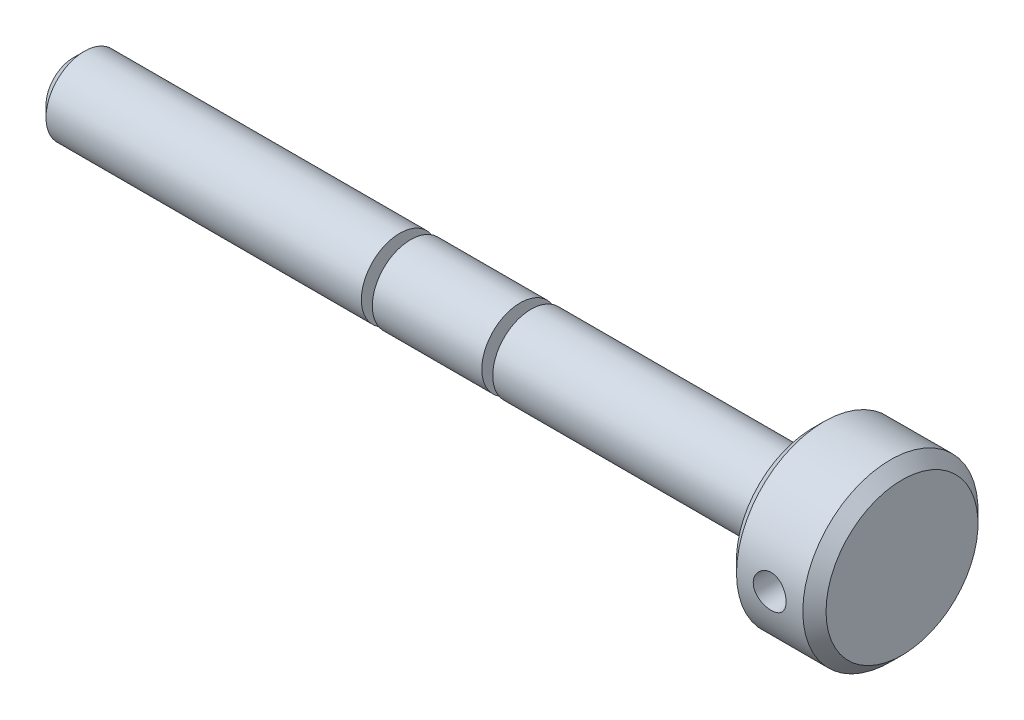
ISO-10303-21;
HEADER;
FILE_DESCRIPTION(('STEP AP214'),'2;1');
FILE_NAME('part.step','',(''),(''),'','','');
FILE_SCHEMA(('AUTOMOTIVE_DESIGN { 1 0 10303 214 1 1 1 1 }'));
ENDSEC;
DATA;
#1=APPLICATION_CONTEXT('core data for automotive mechanical design processes');
#2=APPLICATION_PROTOCOL_DEFINITION('international standard','automotive_design',2000,#1);
#3=PRODUCT_CONTEXT('',#1,'mechanical');
#4=PRODUCT('Part','Part','',(#3));
#5=PRODUCT_RELATED_PRODUCT_CATEGORY('part','',(#4));
#6=PRODUCT_DEFINITION_FORMATION('','',#4);
#7=PRODUCT_DEFINITION_CONTEXT('part definition',#1,'design');
#8=PRODUCT_DEFINITION('design','',#6,#7);
#9=PRODUCT_DEFINITION_SHAPE('','',#8);
#10=(LENGTH_UNIT() NAMED_UNIT(*) SI_UNIT(.MILLI.,.METRE.));
#11=(NAMED_UNIT(*) PLANE_ANGLE_UNIT() SI_UNIT($,.RADIAN.));
#12=(NAMED_UNIT(*) SI_UNIT($,.STERADIAN.) SOLID_ANGLE_UNIT());
#13=UNCERTAINTY_MEASURE_WITH_UNIT(LENGTH_MEASURE(1.E-05),#10,'distance_accuracy_value','');
#14=(GEOMETRIC_REPRESENTATION_CONTEXT(3) GLOBAL_UNCERTAINTY_ASSIGNED_CONTEXT((#13)) GLOBAL_UNIT_ASSIGNED_CONTEXT((#10,
#11,#12)) REPRESENTATION_CONTEXT('',''));
#15=CARTESIAN_POINT('',(0.,0.,0.));
#16=DIRECTION('',(0.,0.,1.));
#17=DIRECTION('',(1.,0.,0.));
#18=AXIS2_PLACEMENT_3D('',#15,#16,#17);
#19=CARTESIAN_POINT('',(-76.6389548693587,0.,0.));
#20=DIRECTION('',(-1.,0.,0.));
#21=DIRECTION('',(0.,0.,1.));
#22=AXIS2_PLACEMENT_3D('',#19,#20,#21);
#23=CYLINDRICAL_SURFACE('',#22,16.);
#24=CARTESIAN_POINT('',(60.4823451306413,0.,0.));
#25=DIRECTION('',(1.,0.,0.));
#26=DIRECTION('',(0.,0.,-1.));
#27=AXIS2_PLACEMENT_3D('',#24,#25,#26);
#28=CIRCLE('',#27,16.);
#29=CARTESIAN_POINT('',(60.4823451306413,0.,-16.));
#30=VERTEX_POINT('',#29);
#31=EDGE_CURVE('E50',#30,#30,#28,.T.);
#32=ORIENTED_EDGE('',*,*,#31,.T.);
#33=EDGE_LOOP('',(#32));
#34=FACE_BOUND('',#33,.T.);
#35=CARTESIAN_POINT('',(72.5936643705463,0.,0.));
#36=DIRECTION('',(-1.,0.,0.));
#37=DIRECTION('',(0.,0.,1.));
#38=AXIS2_PLACEMENT_3D('',#35,#36,#37);
#39=CIRCLE('',#38,16.);
#40=CARTESIAN_POINT('',(72.5936643705463,0.,16.));
#41=VERTEX_POINT('',#40);
#42=EDGE_CURVE('E55',#41,#41,#39,.T.);
#43=ORIENTED_EDGE('',*,*,#42,.T.);
#44=EDGE_LOOP('',(#43));
#45=FACE_BOUND('',#44,.T.);
#46=CARTESIAN_POINT('',(63.5380047505938,0.,-16.));
#47=CARTESIAN_POINT('',(63.5380111297704,0.166943492930942,-15.999996976677));
#48=CARTESIAN_POINT('',(63.5519869038326,0.333969985460196,-15.9973601984343));
#49=CARTESIAN_POINT('',(63.6074847408305,0.663316259683596,-15.9870957178104));
#50=CARTESIAN_POINT('',(63.6490300518733,0.825631948304454,-15.9794638033379));
#51=CARTESIAN_POINT('',(63.7583501531125,1.14074592370361,-15.9600627753092));
#52=CARTESIAN_POINT('',(63.8261012554989,1.29355266137069,-15.9482973989297));
#53=CARTESIAN_POINT('',(63.9858425044394,1.58561594618802,-15.9219142119957));
#54=CARTESIAN_POINT('',(64.0778306888835,1.72487358895465,-15.9072966323658));
#55=CARTESIAN_POINT('',(64.2846042866012,1.98756743186101,-15.8766267286101));
#56=CARTESIAN_POINT('',(64.3996236399341,2.11081791006367,-15.860560697127));
#57=CARTESIAN_POINT('',(64.6486913687689,2.33639212270739,-15.828906369173));
#58=CARTESIAN_POINT('',(64.7827411101324,2.43871435378483,-15.8133181070905));
#59=CARTESIAN_POINT('',(65.0673769273218,2.62029997331586,-15.7842510249001));
#60=CARTESIAN_POINT('',(65.2180854912283,2.69937443939211,-15.7707898777236));
#61=CARTESIAN_POINT('',(65.5309425809474,2.83101048664567,-15.7476942642397));
#62=CARTESIAN_POINT('',(65.6930901188162,2.88357435426197,-15.7380594679392));
#63=CARTESIAN_POINT('',(66.0222352124226,2.96010107007001,-15.723845391491));
#64=CARTESIAN_POINT('',(66.1891549450007,2.98438780384079,-15.7192089073281));
#65=CARTESIAN_POINT('',(66.5247595202103,3.00467616190693,-15.7153439430552));
#66=CARTESIAN_POINT('',(66.6934442031984,3.00068032270749,-15.7161149779752));
#67=CARTESIAN_POINT('',(67.0254438011259,2.96477959204726,-15.7229258540351));
#68=CARTESIAN_POINT('',(67.1888001791941,2.9332429999209,-15.7288961629467));
#69=CARTESIAN_POINT('',(67.5078615901591,2.84373598792414,-15.7453236656933));
#70=CARTESIAN_POINT('',(67.6635662976124,2.78576444478999,-15.7557810501903));
#71=CARTESIAN_POINT('',(67.9639821085944,2.644672943586,-15.7800771058518));
#72=CARTESIAN_POINT('',(68.1086216917555,2.56140427064912,-15.7939356764673));
#73=CARTESIAN_POINT('',(68.3820142076743,2.37218737860833,-15.8234594320584));
#74=CARTESIAN_POINT('',(68.5107655260234,2.26623685778533,-15.8391248003104));
#75=CARTESIAN_POINT('',(68.7508546619387,2.03267811370596,-15.8708000254433));
#76=CARTESIAN_POINT('',(68.8618860554973,1.90475487372137,-15.8868114204806));
#77=CARTESIAN_POINT('',(69.0609592319446,1.63193607419765,-15.9171477221664));
#78=CARTESIAN_POINT('',(69.1490007843347,1.48704034451154,-15.9314726119049));
#79=CARTESIAN_POINT('',(69.2996402583339,1.18406997774933,-15.9568507935502));
#80=CARTESIAN_POINT('',(69.3622063088296,1.02597912889298,-15.9678999827258));
#81=CARTESIAN_POINT('',(69.4598089367782,0.701278230797392,-15.9854501080544));
#82=CARTESIAN_POINT('',(69.4948484386845,0.534669088555576,-15.9919515273599));
#83=CARTESIAN_POINT('',(69.5359768126304,0.200297305806774,-15.9996072128396));
#84=CARTESIAN_POINT('',(69.5424855336533,0.0325880252682737,-16.0008390182456));
#85=CARTESIAN_POINT('',(69.5274937914985,-0.301522496184366,-15.9980308719646));
#86=CARTESIAN_POINT('',(69.5059947044633,-0.467923800960769,-15.9939911792886));
#87=CARTESIAN_POINT('',(69.4359466802271,-0.793363146436433,-15.9811422300081));
#88=CARTESIAN_POINT('',(69.3876101855182,-0.952448522092126,-15.9723704474806));
#89=CARTESIAN_POINT('',(69.2654893370363,-1.26025726364927,-15.95103684425));
#90=CARTESIAN_POINT('',(69.1917032554623,-1.40897992519021,-15.9384747662267));
#91=CARTESIAN_POINT('',(69.0198484942748,-1.69363334302643,-15.9107606071533));
#92=CARTESIAN_POINT('',(68.9215232735202,-1.82940655403024,-15.8955817234913));
#93=CARTESIAN_POINT('',(68.7037284758691,-2.08267664652909,-15.8643868697942));
#94=CARTESIAN_POINT('',(68.5842569245912,-2.20017181952174,-15.8483708216937));
#95=CARTESIAN_POINT('',(68.325660112771,-2.41514591744096,-15.817049513949));
#96=CARTESIAN_POINT('',(68.1862949343431,-2.51233832437154,-15.8017565172051));
#97=CARTESIAN_POINT('',(67.8929695015463,-2.68193350115574,-15.7738597115706));
#98=CARTESIAN_POINT('',(67.7390097898529,-2.75433719227849,-15.761255802747));
#99=CARTESIAN_POINT('',(67.4215930161088,-2.87189347025647,-15.7402604841915));
#100=CARTESIAN_POINT('',(67.2581859914752,-2.91717737589573,-15.7318488087376));
#101=CARTESIAN_POINT('',(66.925910305551,-2.97961358652472,-15.7201440760483));
#102=CARTESIAN_POINT('',(66.757042262653,-2.99676906541417,-15.7168504413158));
#103=CARTESIAN_POINT('',(66.4215080877108,-3.0023552429671,-15.7157839960771));
#104=CARTESIAN_POINT('',(66.2548495886798,-2.99123790006999,-15.7179243194859));
#105=CARTESIAN_POINT('',(65.9258219065032,-2.94158350757607,-15.7272920132));
#106=CARTESIAN_POINT('',(65.7634526977389,-2.90304662178665,-15.7345193531149));
#107=CARTESIAN_POINT('',(65.4478557810029,-2.79983775166527,-15.7532101604636));
#108=CARTESIAN_POINT('',(65.2946115679023,-2.73521470794506,-15.7646656918993));
#109=CARTESIAN_POINT('',(65.0010682421121,-2.58171737824409,-15.7905277510368));
#110=CARTESIAN_POINT('',(64.8607700449043,-2.49284137896372,-15.8049344872024));
#111=CARTESIAN_POINT('',(64.5948373905092,-2.29178974679071,-15.8353453221549));
#112=CARTESIAN_POINT('',(64.4694539254596,-2.17928519728608,-15.8513701070609));
#113=CARTESIAN_POINT('',(64.2391944256648,-1.93485585348459,-15.8830566783747));
#114=CARTESIAN_POINT('',(64.1343231086336,-1.80292660378323,-15.8987183805466));
#115=CARTESIAN_POINT('',(63.9471828453397,-1.52196989014374,-15.928079519361));
#116=CARTESIAN_POINT('',(63.8651258936125,-1.37279918128103,-15.9417600198112));
#117=CARTESIAN_POINT('',(63.7273694773835,-1.06258022730767,-15.9654323876137));
#118=CARTESIAN_POINT('',(63.6716452565,-0.901543303410495,-15.9754277175807));
#119=CARTESIAN_POINT('',(63.5994501217565,-0.616694405650308,-15.9885658141526));
#120=CARTESIAN_POINT('',(63.5764474899682,-0.494547620503742,-15.9928294175641));
#121=CARTESIAN_POINT('',(63.5457226263609,-0.248282494230317,-15.9985475990802));
#122=CARTESIAN_POINT('',(63.538000006082,-0.124164203305419,-16.0000022485961));
#123=CARTESIAN_POINT('',(63.5380047505938,0.,-16.));
#124=B_SPLINE_CURVE_WITH_KNOTS('',3,(#46,#47,#48,#49,#50,#51,#52,#53,#54,#55,#56,#57,#58,#59,
#60,#61,#62,#63,#64,#65,#66,#67,#68,#69,#70,#71,#72,#73,#74,#75,#76,#77,#78,#79,#80,#81,#82,#83,
#84,#85,#86,#87,#88,#89,#90,#91,#92,#93,#94,#95,#96,#97,#98,#99,#100,#101,#102,#103,#104,#105,
#106,#107,#108,#109,#110,#111,#112,#113,#114,#115,#116,#117,#118,#119,#120,#121,#122,#123),
.UNSPECIFIED.,.T.,.F.,(4,2,2,2,2,2,2,2,2,2,2,2,2,2,2,2,2,2,2,2,2,2,2,2,2,2,2,2,2,2,2,2,2,2,2,2,
2,2,4),(0.,0.500376401929849,1.0011752850709,1.50152254246182,2.00182930673782,2.50750236027261,
3.01321172567234,3.52292381008715,4.03259192623896,4.53636302890672,5.04008895174512,
5.53718001225533,6.03429219693575,6.53438525259063,7.0345290809972,7.54255536928156,
8.05058675089898,8.559251766434,9.06786273347493,9.56896348152196,10.0700396092917,
10.5672046781566,11.0644035067607,11.5670355603542,12.069714568262,12.579068739746,
13.0884039790989,13.5952525563712,14.1020439389303,14.600785044635,15.0995231708302,
15.5973299241539,16.0951718531085,16.6004673993276,17.1058790252452,17.6158409783263,
18.1253225386235,18.4974868904882,18.8696417807909),.UNSPECIFIED.);
#125=CARTESIAN_POINT('',(63.5380047505938,0.,-16.));
#126=VERTEX_POINT('',#125);
#127=EDGE_CURVE('E58',#126,#126,#124,.T.);
#128=ORIENTED_EDGE('',*,*,#127,.F.);
#129=EDGE_LOOP('',(#128));
#130=FACE_BOUND('',#129,.T.);
#131=CARTESIAN_POINT('',(69.5380047505938,0.,16.));
#132=CARTESIAN_POINT('',(69.5379983714173,0.166943492930942,15.999996976677));
#133=CARTESIAN_POINT('',(69.5240225973551,0.333969985460196,15.9973601984343));
#134=CARTESIAN_POINT('',(69.4685247603571,0.663316259683596,15.9870957178104));
#135=CARTESIAN_POINT('',(69.4269794493144,0.825631948304454,15.9794638033379));
#136=CARTESIAN_POINT('',(69.3176593480752,1.14074592370361,15.9600627753092));
#137=CARTESIAN_POINT('',(69.2499082456887,1.29355266137069,15.9482973989297));
#138=CARTESIAN_POINT('',(69.0901669967482,1.58561594618802,15.9219142119957));
#139=CARTESIAN_POINT('',(68.9981788123042,1.72487358895465,15.9072966323658));
#140=CARTESIAN_POINT('',(68.7914052145865,1.98756743186101,15.8766267286101));
#141=CARTESIAN_POINT('',(68.6763858612536,2.11081791006367,15.860560697127));
#142=CARTESIAN_POINT('',(68.4273181324187,2.33639212270739,15.828906369173));
#143=CARTESIAN_POINT('',(68.2932683910552,2.43871435378483,15.8133181070905));
#144=CARTESIAN_POINT('',(68.0086325738659,2.62029997331586,15.7842510249001));
#145=CARTESIAN_POINT('',(67.8579240099593,2.69937443939211,15.7707898777236));
#146=CARTESIAN_POINT('',(67.5450669202402,2.83101048664567,15.7476942642397));
#147=CARTESIAN_POINT('',(67.3829193823714,2.88357435426197,15.7380594679392));
#148=CARTESIAN_POINT('',(67.053774288765,2.96010107007001,15.723845391491));
#149=CARTESIAN_POINT('',(66.8868545561869,2.98438780384078,15.7192089073281));
#150=CARTESIAN_POINT('',(66.5512499809773,3.00467616190693,15.7153439430552));
#151=CARTESIAN_POINT('',(66.3825652979892,3.00068032270749,15.7161149779752));
#152=CARTESIAN_POINT('',(66.0505657000617,2.96477959204726,15.7229258540351));
#153=CARTESIAN_POINT('',(65.8872093219935,2.9332429999209,15.7288961629467));
#154=CARTESIAN_POINT('',(65.5681479110286,2.84373598792414,15.7453236656933));
#155=CARTESIAN_POINT('',(65.4124432035752,2.78576444478999,15.7557810501903));
#156=CARTESIAN_POINT('',(65.1120273925933,2.644672943586,15.7800771058518));
#157=CARTESIAN_POINT('',(64.9673878094322,2.56140427064912,15.7939356764673));
#158=CARTESIAN_POINT('',(64.6939952935133,2.37218737860833,15.8234594320584));
#159=CARTESIAN_POINT('',(64.5652439751642,2.26623685778533,15.8391248003104));
#160=CARTESIAN_POINT('',(64.3251548392489,2.03267811370596,15.8708000254433));
#161=CARTESIAN_POINT('',(64.2141234456903,1.90475487372137,15.8868114204806));
#162=CARTESIAN_POINT('',(64.015050269243,1.63193607419765,15.9171477221664));
#163=CARTESIAN_POINT('',(63.927008716853,1.48704034451154,15.9314726119049));
#164=CARTESIAN_POINT('',(63.7763692428538,1.18406997774933,15.9568507935502));
#165=CARTESIAN_POINT('',(63.713803192358,1.02597912889298,15.9678999827258));
#166=CARTESIAN_POINT('',(63.6162005644095,0.701278230797392,15.9854501080544));
#167=CARTESIAN_POINT('',(63.5811610625031,0.534669088555576,15.9919515273599));
#168=CARTESIAN_POINT('',(63.5400326885573,0.200297305806774,15.9996072128396));
#169=CARTESIAN_POINT('',(63.5335239675344,0.0325880252682737,16.0008390182456));
#170=CARTESIAN_POINT('',(63.5485157096891,-0.301522496184366,15.9980308719646));
#171=CARTESIAN_POINT('',(63.5700147967243,-0.467923800960769,15.9939911792886));
#172=CARTESIAN_POINT('',(63.6400628209605,-0.793363146436433,15.9811422300081));
#173=CARTESIAN_POINT('',(63.6883993156694,-0.952448522092126,15.9723704474806));
#174=CARTESIAN_POINT('',(63.8105201641514,-1.26025726364927,15.95103684425));
#175=CARTESIAN_POINT('',(63.8843062457254,-1.40897992519021,15.9384747662267));
#176=CARTESIAN_POINT('',(64.0561610069128,-1.69363334302643,15.9107606071533));
#177=CARTESIAN_POINT('',(64.1544862276675,-1.82940655403024,15.8955817234913));
#178=CARTESIAN_POINT('',(64.3722810253185,-2.08267664652909,15.8643868697942));
#179=CARTESIAN_POINT('',(64.4917525765965,-2.20017181952174,15.8483708216937));
#180=CARTESIAN_POINT('',(64.7503493884167,-2.41514591744096,15.817049513949));
#181=CARTESIAN_POINT('',(64.8897145668446,-2.51233832437153,15.8017565172051));
#182=CARTESIAN_POINT('',(65.1830399996413,-2.68193350115574,15.7738597115706));
#183=CARTESIAN_POINT('',(65.3369997113347,-2.75433719227849,15.761255802747));
#184=CARTESIAN_POINT('',(65.6544164850789,-2.87189347025647,15.7402604841915));
#185=CARTESIAN_POINT('',(65.8178235097125,-2.91717737589573,15.7318488087376));
#186=CARTESIAN_POINT('',(66.1500991956366,-2.97961358652472,15.7201440760483));
#187=CARTESIAN_POINT('',(66.3189672385346,-2.99676906541417,15.7168504413158));
#188=CARTESIAN_POINT('',(66.6545014134768,-3.0023552429671,15.7157839960771));
#189=CARTESIAN_POINT('',(66.8211599125078,-2.99123790006999,15.7179243194859));
#190=CARTESIAN_POINT('',(67.1501875946844,-2.94158350757607,15.7272920132));
#191=CARTESIAN_POINT('',(67.3125568034487,-2.90304662178665,15.7345193531149));
#192=CARTESIAN_POINT('',(67.6281537201848,-2.79983775166527,15.7532101604636));
#193=CARTESIAN_POINT('',(67.7813979332854,-2.73521470794506,15.7646656918993));
#194=CARTESIAN_POINT('',(68.0749412590755,-2.58171737824409,15.7905277510368));
#195=CARTESIAN_POINT('',(68.2152394562834,-2.49284137896372,15.8049344872024));
#196=CARTESIAN_POINT('',(68.4811721106784,-2.29178974679071,15.8353453221549));
#197=CARTESIAN_POINT('',(68.606555575728,-2.17928519728608,15.8513701070609));
#198=CARTESIAN_POINT('',(68.8368150755229,-1.93485585348459,15.8830566783747));
#199=CARTESIAN_POINT('',(68.9416863925541,-1.80292660378323,15.8987183805466));
#200=CARTESIAN_POINT('',(69.1288266558479,-1.52196989014374,15.928079519361));
#201=CARTESIAN_POINT('',(69.2108836075751,-1.37279918128103,15.9417600198112));
#202=CARTESIAN_POINT('',(69.3486400238041,-1.06258022730767,15.9654323876137));
#203=CARTESIAN_POINT('',(69.4043642446877,-0.901543303410495,15.9754277175807));
#204=CARTESIAN_POINT('',(69.4765593794312,-0.616694405650308,15.9885658141526));
#205=CARTESIAN_POINT('',(69.4995620112194,-0.494547620503742,15.9928294175641));
#206=CARTESIAN_POINT('',(69.5302868748267,-0.248282494230317,15.9985475990802));
#207=CARTESIAN_POINT('',(69.5380094951056,-0.124164203305419,16.0000022485961));
#208=CARTESIAN_POINT('',(69.5380047505938,0.,16.));
#209=B_SPLINE_CURVE_WITH_KNOTS('',3,(#131,#132,#133,#134,#135,#136,#137,#138,#139,#140,#141,
#142,#143,#144,#145,#146,#147,#148,#149,#150,#151,#152,#153,#154,#155,#156,#157,#158,#159,#160,
#161,#162,#163,#164,#165,#166,#167,#168,#169,#170,#171,#172,#173,#174,#175,#176,#177,#178,#179,
#180,#181,#182,#183,#184,#185,#186,#187,#188,#189,#190,#191,#192,#193,#194,#195,#196,#197,#198,
#199,#200,#201,#202,#203,#204,#205,#206,#207,#208),.UNSPECIFIED.,.T.,.F.,(4,2,2,2,2,2,2,2,2,2,2,
2,2,2,2,2,2,2,2,2,2,2,2,2,2,2,2,2,2,2,2,2,2,2,2,2,2,2,4),(0.,0.500376401929849,1.0011752850709,
1.50152254246182,2.00182930673782,2.50750236027261,3.01321172567234,3.52292381008715,
4.03259192623896,4.53636302890671,5.04008895174512,5.53718001225533,6.03429219693575,
6.53438525259063,7.0345290809972,7.54255536928156,8.05058675089898,8.559251766434,
9.06786273347493,9.56896348152195,10.0700396092917,10.5672046781566,11.0644035067607,
11.5670355603542,12.069714568262,12.579068739746,13.0884039790989,13.5952525563712,
14.1020439389303,14.600785044635,15.0995231708302,15.5973299241539,16.0951718531085,
16.6004673993276,17.1058790252452,17.6158409783263,18.1253225386235,18.4974868904882,
18.8696417807909),.UNSPECIFIED.);
#210=CARTESIAN_POINT('',(69.5380047505938,0.,16.));
#211=VERTEX_POINT('',#210);
#212=EDGE_CURVE('E41',#211,#211,#209,.T.);
#213=ORIENTED_EDGE('',*,*,#212,.F.);
#214=EDGE_LOOP('',(#213));
#215=FACE_BOUND('',#214,.T.);
#216=ADVANCED_FACE('F37',(#34,#45,#130,#215),#23,.T.);
#217=CARTESIAN_POINT('',(-76.6389548693587,7.,0.));
#218=DIRECTION('',(1.,0.,0.));
#219=DIRECTION('',(0.,0.,-1.));
#220=AXIS2_PLACEMENT_3D('',#217,#218,#219);
#221=PLANE('',#220);
#222=CARTESIAN_POINT('',(-76.6389548693587,0.,0.));
#223=DIRECTION('',(1.,0.,0.));
#224=DIRECTION('',(0.,0.,-1.));
#225=AXIS2_PLACEMENT_3D('',#222,#223,#224);
#226=CIRCLE('',#225,4.99999999999999);
#227=CARTESIAN_POINT('',(-76.6389548693587,0.,-4.99999999999999));
#228=VERTEX_POINT('',#227);
#229=EDGE_CURVE('E165',#228,#228,#226,.F.);
#230=ORIENTED_EDGE('',*,*,#229,.T.);
#231=EDGE_LOOP('',(#230));
#232=FACE_BOUND('',#231,.T.);
#233=ADVANCED_FACE('F115',(#232),#221,.F.);
#234=CARTESIAN_POINT('',(74.7149643705463,0.,0.));
#235=DIRECTION('',(-1.,0.,0.));
#236=DIRECTION('',(0.,0.,1.));
#237=AXIS2_PLACEMENT_3D('',#234,#235,#236);
#238=PLANE('',#237);
#239=CARTESIAN_POINT('',(74.7149643705463,0.,0.));
#240=DIRECTION('',(-1.,0.,0.));
#241=DIRECTION('',(0.,0.,1.));
#242=AXIS2_PLACEMENT_3D('',#239,#240,#241);
#243=CIRCLE('',#242,13.8787);
#244=CARTESIAN_POINT('',(74.7149643705463,0.,13.8787));
#245=VERTEX_POINT('',#244);
#246=EDGE_CURVE('E10',#245,#245,#243,.F.);
#247=ORIENTED_EDGE('',*,*,#246,.T.);
#248=EDGE_LOOP('',(#247));
#249=FACE_BOUND('',#248,.T.);
#250=ADVANCED_FACE('F110',(#249),#238,.F.);
#251=CARTESIAN_POINT('',(58.3610451306413,16.,0.));
#252=DIRECTION('',(1.,0.,0.));
#253=DIRECTION('',(0.,0.,-1.));
#254=AXIS2_PLACEMENT_3D('',#251,#252,#253);
#255=PLANE('',#254);
#256=CARTESIAN_POINT('',(58.3610451306413,0.,0.));
#257=DIRECTION('',(1.,0.,0.));
#258=DIRECTION('',(0.,0.,-1.));
#259=AXIS2_PLACEMENT_3D('',#256,#257,#258);
#260=CIRCLE('',#259,13.8787);
#261=CARTESIAN_POINT('',(58.3610451306413,0.,-13.8787));
#262=VERTEX_POINT('',#261);
#263=EDGE_CURVE('E171',#262,#262,#260,.F.);
#264=ORIENTED_EDGE('',*,*,#263,.T.);
#265=EDGE_LOOP('',(#264));
#266=FACE_BOUND('',#265,.T.);
#267=CARTESIAN_POINT('',(58.3610451306413,0.,0.));
#268=DIRECTION('',(-1.,0.,0.));
#269=DIRECTION('',(0.,0.,1.));
#270=AXIS2_PLACEMENT_3D('',#267,#268,#269);
#271=CIRCLE('',#270,7.00000000000003);
#272=CARTESIAN_POINT('',(58.3610451306413,0.,7.00000000000003));
#273=VERTEX_POINT('',#272);
#274=EDGE_CURVE('E162',#273,#273,#271,.T.);
#275=ORIENTED_EDGE('',*,*,#274,.F.);
#276=EDGE_LOOP('',(#275));
#277=FACE_BOUND('',#276,.T.);
#278=ADVANCED_FACE('F107',(#266,#277),#255,.F.);
#279=CARTESIAN_POINT('',(-76.6389548693587,0.,0.));
#280=DIRECTION('',(-1.,0.,0.));
#281=DIRECTION('',(0.,0.,1.));
#282=AXIS2_PLACEMENT_3D('',#279,#280,#281);
#283=CYLINDRICAL_SURFACE('',#282,7.00000000000002);
#284=CARTESIAN_POINT('',(6.96104513064133,0.,0.));
#285=DIRECTION('',(-1.,0.,0.));
#286=DIRECTION('',(0.,0.,1.));
#287=AXIS2_PLACEMENT_3D('',#284,#285,#286);
#288=CIRCLE('',#287,7.00000000000002);
#289=CARTESIAN_POINT('',(6.96104513064133,0.,7.00000000000002));
#290=VERTEX_POINT('',#289);
#291=EDGE_CURVE('E159',#290,#290,#288,.T.);
#292=ORIENTED_EDGE('',*,*,#291,.F.);
#293=EDGE_LOOP('',(#292));
#294=FACE_BOUND('',#293,.T.);
#295=ORIENTED_EDGE('',*,*,#274,.T.);
#296=EDGE_LOOP('',(#295));
#297=FACE_BOUND('',#296,.T.);
#298=ADVANCED_FACE('F104',(#294,#297),#283,.T.);
#299=CARTESIAN_POINT('',(6.96104513064133,7.00000000000002,0.));
#300=DIRECTION('',(1.,0.,0.));
#301=DIRECTION('',(0.,0.,-1.));
#302=AXIS2_PLACEMENT_3D('',#299,#300,#301);
#303=PLANE('',#302);
#304=CARTESIAN_POINT('',(6.96104513064133,0.,0.));
#305=DIRECTION('',(-1.,0.,0.));
#306=DIRECTION('',(0.,0.,1.));
#307=AXIS2_PLACEMENT_3D('',#304,#305,#306);
#308=CIRCLE('',#307,2.99168646080763);
#309=CARTESIAN_POINT('',(6.96104513064133,0.,2.99168646080763));
#310=VERTEX_POINT('',#309);
#311=EDGE_CURVE('E156',#310,#310,#308,.T.);
#312=ORIENTED_EDGE('',*,*,#311,.F.);
#313=EDGE_LOOP('',(#312));
#314=FACE_BOUND('',#313,.T.);
#315=ORIENTED_EDGE('',*,*,#291,.T.);
#316=EDGE_LOOP('',(#315));
#317=FACE_BOUND('',#316,.T.);
#318=ADVANCED_FACE('F100',(#314,#317),#303,.F.);
#319=CARTESIAN_POINT('',(-76.6389548693587,0.,0.));
#320=DIRECTION('',(-1.,0.,0.));
#321=DIRECTION('',(0.,0.,1.));
#322=AXIS2_PLACEMENT_3D('',#319,#320,#321);
#323=CYLINDRICAL_SURFACE('',#322,2.99168646080763);
#324=CARTESIAN_POINT('',(4.96104513064133,0.,0.));
#325=DIRECTION('',(-1.,0.,0.));
#326=DIRECTION('',(0.,0.,1.));
#327=AXIS2_PLACEMENT_3D('',#324,#325,#326);
#328=CIRCLE('',#327,2.99168646080763);
#329=CARTESIAN_POINT('',(4.96104513064133,0.,2.99168646080763));
#330=VERTEX_POINT('',#329);
#331=EDGE_CURVE('E153',#330,#330,#328,.T.);
#332=ORIENTED_EDGE('',*,*,#331,.F.);
#333=EDGE_LOOP('',(#332));
#334=FACE_BOUND('',#333,.T.);
#335=ORIENTED_EDGE('',*,*,#311,.T.);
#336=EDGE_LOOP('',(#335));
#337=FACE_BOUND('',#336,.T.);
#338=ADVANCED_FACE('F96',(#334,#337),#323,.T.);
#339=CARTESIAN_POINT('',(4.96104513064133,2.99168646080763,0.));
#340=DIRECTION('',(-1.,0.,0.));
#341=DIRECTION('',(0.,0.,1.));
#342=AXIS2_PLACEMENT_3D('',#339,#340,#341);
#343=PLANE('',#342);
#344=CARTESIAN_POINT('',(4.96104513064133,0.,0.));
#345=DIRECTION('',(-1.,0.,0.));
#346=DIRECTION('',(0.,0.,1.));
#347=AXIS2_PLACEMENT_3D('',#344,#345,#346);
#348=CIRCLE('',#347,7.00000000000002);
#349=CARTESIAN_POINT('',(4.96104513064133,0.,7.00000000000002));
#350=VERTEX_POINT('',#349);
#351=EDGE_CURVE('E150',#350,#350,#348,.T.);
#352=ORIENTED_EDGE('',*,*,#351,.F.);
#353=EDGE_LOOP('',(#352));
#354=FACE_BOUND('',#353,.T.);
#355=ORIENTED_EDGE('',*,*,#331,.T.);
#356=EDGE_LOOP('',(#355));
#357=FACE_BOUND('',#356,.T.);
#358=ADVANCED_FACE('F92',(#354,#357),#343,.F.);
#359=CARTESIAN_POINT('',(-76.6389548693587,0.,0.));
#360=DIRECTION('',(-1.,0.,0.));
#361=DIRECTION('',(0.,0.,1.));
#362=AXIS2_PLACEMENT_3D('',#359,#360,#361);
#363=CYLINDRICAL_SURFACE('',#362,7.00000000000001);
#364=CARTESIAN_POINT('',(-15.0389548693587,0.,0.));
#365=DIRECTION('',(-1.,0.,0.));
#366=DIRECTION('',(0.,0.,1.));
#367=AXIS2_PLACEMENT_3D('',#364,#365,#366);
#368=CIRCLE('',#367,7.00000000000001);
#369=CARTESIAN_POINT('',(-15.0389548693587,0.,7.00000000000001));
#370=VERTEX_POINT('',#369);
#371=EDGE_CURVE('E147',#370,#370,#368,.T.);
#372=ORIENTED_EDGE('',*,*,#371,.F.);
#373=EDGE_LOOP('',(#372));
#374=FACE_BOUND('',#373,.T.);
#375=ORIENTED_EDGE('',*,*,#351,.T.);
#376=EDGE_LOOP('',(#375));
#377=FACE_BOUND('',#376,.T.);
#378=ADVANCED_FACE('F88',(#374,#377),#363,.T.);
#379=CARTESIAN_POINT('',(-15.0389548693587,7.00000000000001,0.));
#380=DIRECTION('',(1.,0.,0.));
#381=DIRECTION('',(0.,0.,-1.));
#382=AXIS2_PLACEMENT_3D('',#379,#380,#381);
#383=PLANE('',#382);
#384=CARTESIAN_POINT('',(-15.0389548693587,0.,0.));
#385=DIRECTION('',(-1.,0.,0.));
#386=DIRECTION('',(0.,0.,1.));
#387=AXIS2_PLACEMENT_3D('',#384,#385,#386);
#388=CIRCLE('',#387,2.99168646080762);
#389=CARTESIAN_POINT('',(-15.0389548693587,0.,2.99168646080762));
#390=VERTEX_POINT('',#389);
#391=EDGE_CURVE('E142',#390,#390,#388,.T.);
#392=ORIENTED_EDGE('',*,*,#391,.F.);
#393=EDGE_LOOP('',(#392));
#394=FACE_BOUND('',#393,.T.);
#395=ORIENTED_EDGE('',*,*,#371,.T.);
#396=EDGE_LOOP('',(#395));
#397=FACE_BOUND('',#396,.T.);
#398=ADVANCED_FACE('F84',(#394,#397),#383,.F.);
#399=CARTESIAN_POINT('',(-76.6389548693587,0.,0.));
#400=DIRECTION('',(-1.,0.,0.));
#401=DIRECTION('',(0.,0.,1.));
#402=AXIS2_PLACEMENT_3D('',#399,#400,#401);
#403=CYLINDRICAL_SURFACE('',#402,2.99168646080762);
#404=CARTESIAN_POINT('',(-17.0389548693587,0.,0.));
#405=DIRECTION('',(-1.,0.,0.));
#406=DIRECTION('',(0.,0.,1.));
#407=AXIS2_PLACEMENT_3D('',#404,#405,#406);
#408=CIRCLE('',#407,2.99168646080762);
#409=CARTESIAN_POINT('',(-17.0389548693587,0.,2.99168646080762));
#410=VERTEX_POINT('',#409);
#411=EDGE_CURVE('E137',#410,#410,#408,.T.);
#412=ORIENTED_EDGE('',*,*,#411,.F.);
#413=EDGE_LOOP('',(#412));
#414=FACE_BOUND('',#413,.T.);
#415=ORIENTED_EDGE('',*,*,#391,.T.);
#416=EDGE_LOOP('',(#415));
#417=FACE_BOUND('',#416,.T.);
#418=ADVANCED_FACE('F80',(#414,#417),#403,.T.);
#419=CARTESIAN_POINT('',(-17.0389548693587,2.99168646080762,0.));
#420=DIRECTION('',(-1.,0.,0.));
#421=DIRECTION('',(0.,0.,1.));
#422=AXIS2_PLACEMENT_3D('',#419,#420,#421);
#423=PLANE('',#422);
#424=CARTESIAN_POINT('',(-17.0389548693587,0.,0.));
#425=DIRECTION('',(-1.,0.,0.));
#426=DIRECTION('',(0.,0.,1.));
#427=AXIS2_PLACEMENT_3D('',#424,#425,#426);
#428=CIRCLE('',#427,7.00000000000001);
#429=CARTESIAN_POINT('',(-17.0389548693587,0.,7.00000000000001));
#430=VERTEX_POINT('',#429);
#431=EDGE_CURVE('E135',#430,#430,#428,.T.);
#432=ORIENTED_EDGE('',*,*,#431,.F.);
#433=EDGE_LOOP('',(#432));
#434=FACE_BOUND('',#433,.T.);
#435=ORIENTED_EDGE('',*,*,#411,.T.);
#436=EDGE_LOOP('',(#435));
#437=FACE_BOUND('',#436,.T.);
#438=ADVANCED_FACE('F76',(#434,#437),#423,.F.);
#439=CARTESIAN_POINT('',(-76.6389548693587,0.,0.));
#440=DIRECTION('',(-1.,0.,0.));
#441=DIRECTION('',(0.,0.,1.));
#442=AXIS2_PLACEMENT_3D('',#439,#440,#441);
#443=CYLINDRICAL_SURFACE('',#442,7.);
#444=CARTESIAN_POINT('',(-74.6389548693587,0.,0.));
#445=DIRECTION('',(1.,0.,0.));
#446=DIRECTION('',(0.,0.,-1.));
#447=AXIS2_PLACEMENT_3D('',#444,#445,#446);
#448=CIRCLE('',#447,7.);
#449=CARTESIAN_POINT('',(-74.6389548693587,0.,-7.));
#450=VERTEX_POINT('',#449);
#451=EDGE_CURVE('E168',#450,#450,#448,.T.);
#452=ORIENTED_EDGE('',*,*,#451,.T.);
#453=EDGE_LOOP('',(#452));
#454=FACE_BOUND('',#453,.T.);
#455=ORIENTED_EDGE('',*,*,#431,.T.);
#456=EDGE_LOOP('',(#455));
#457=FACE_BOUND('',#456,.T.);
#458=ADVANCED_FACE('F71',(#454,#457),#443,.T.);
#459=CARTESIAN_POINT('',(-76.6389548693587,0.,0.));
#460=DIRECTION('',(1.,0.,0.));
#461=DIRECTION('',(0.,0.,-1.));
#462=AXIS2_PLACEMENT_3D('',#459,#460,#461);
#463=CONICAL_SURFACE('',#462,4.99999999999999,0.785398163397448);
#464=ORIENTED_EDGE('',*,*,#451,.F.);
#465=EDGE_LOOP('',(#464));
#466=FACE_BOUND('',#465,.T.);
#467=ORIENTED_EDGE('',*,*,#229,.F.);
#468=EDGE_LOOP('',(#467));
#469=FACE_BOUND('',#468,.T.);
#470=ADVANCED_FACE('F75',(#466,#469),#463,.T.);
#471=CARTESIAN_POINT('',(58.3610451306413,0.,0.));
#472=DIRECTION('',(1.,0.,0.));
#473=DIRECTION('',(0.,0.,-1.));
#474=AXIS2_PLACEMENT_3D('',#471,#472,#473);
#475=CONICAL_SURFACE('',#474,13.8787,0.785398163397448);
#476=ORIENTED_EDGE('',*,*,#31,.F.);
#477=EDGE_LOOP('',(#476));
#478=FACE_BOUND('',#477,.T.);
#479=ORIENTED_EDGE('',*,*,#263,.F.);
#480=EDGE_LOOP('',(#479));
#481=FACE_BOUND('',#480,.T.);
#482=ADVANCED_FACE('F174',(#478,#481),#475,.T.);
#483=CARTESIAN_POINT('',(72.5936643705463,0.,0.));
#484=DIRECTION('',(-1.,0.,0.));
#485=DIRECTION('',(0.,0.,1.));
#486=AXIS2_PLACEMENT_3D('',#483,#484,#485);
#487=CONICAL_SURFACE('',#486,16.,0.785398163397451);
#488=ORIENTED_EDGE('',*,*,#246,.F.);
#489=EDGE_LOOP('',(#488));
#490=FACE_BOUND('',#489,.T.);
#491=ORIENTED_EDGE('',*,*,#42,.F.);
#492=EDGE_LOOP('',(#491));
#493=FACE_BOUND('',#492,.T.);
#494=ADVANCED_FACE('F39',(#490,#493),#487,.T.);
#495=CARTESIAN_POINT('',(66.5380047505938,0.,135.));
#496=DIRECTION('',(0.,0.,-1.));
#497=DIRECTION('',(-1.,0.,0.));
#498=AXIS2_PLACEMENT_3D('',#495,#496,#497);
#499=CYLINDRICAL_SURFACE('',#498,3.00000000000001);
#500=ORIENTED_EDGE('',*,*,#127,.T.);
#501=EDGE_LOOP('',(#500));
#502=FACE_BOUND('',#501,.T.);
#503=ORIENTED_EDGE('',*,*,#212,.T.);
#504=EDGE_LOOP('',(#503));
#505=FACE_BOUND('',#504,.T.);
#506=ADVANCED_FACE('F66',(#502,#505),#499,.F.);
#507=CLOSED_SHELL('',(#216,#233,#250,#278,#298,#318,#338,#358,#378,#398,#418,#438,#458,#470,
#482,#494,#506));
#508=MANIFOLD_SOLID_BREP('B2',#507);
#509=ADVANCED_BREP_SHAPE_REPRESENTATION('',(#18,#508),#14);
#510=SHAPE_DEFINITION_REPRESENTATION(#9,#509);
ENDSEC;
END-ISO-10303-21;
